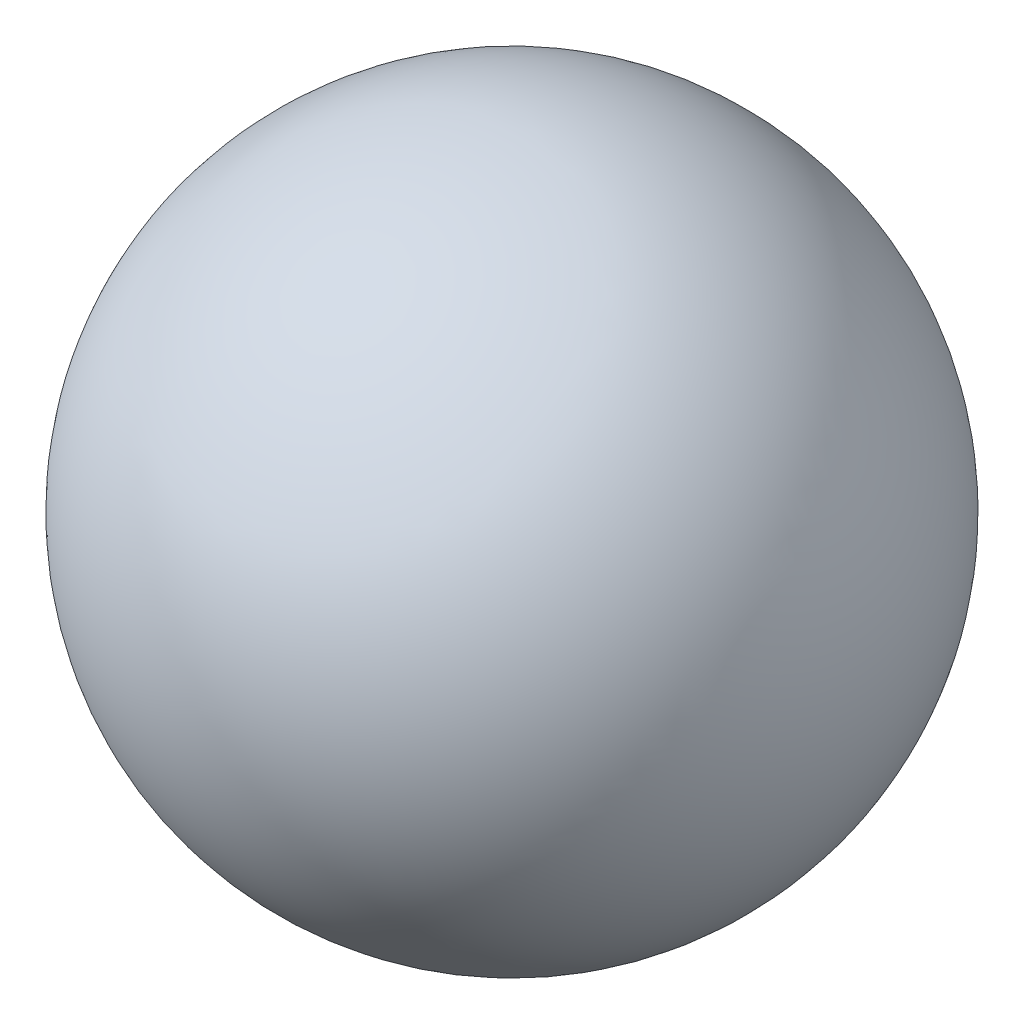
ISO-10303-21;
HEADER;
FILE_DESCRIPTION(('STEP AP214'),'2;1');
FILE_NAME('part.step','',(''),(''),'','','');
FILE_SCHEMA(('AUTOMOTIVE_DESIGN { 1 0 10303 214 1 1 1 1 }'));
ENDSEC;
DATA;
#1=APPLICATION_CONTEXT('core data for automotive mechanical design processes');
#2=APPLICATION_PROTOCOL_DEFINITION('international standard','automotive_design',2000,#1);
#3=PRODUCT_CONTEXT('',#1,'mechanical');
#4=PRODUCT('Part','Part','',(#3));
#5=PRODUCT_RELATED_PRODUCT_CATEGORY('part','',(#4));
#6=PRODUCT_DEFINITION_FORMATION('','',#4);
#7=PRODUCT_DEFINITION_CONTEXT('part definition',#1,'design');
#8=PRODUCT_DEFINITION('design','',#6,#7);
#9=PRODUCT_DEFINITION_SHAPE('','',#8);
#10=(LENGTH_UNIT() NAMED_UNIT(*) SI_UNIT(.MILLI.,.METRE.));
#11=(NAMED_UNIT(*) PLANE_ANGLE_UNIT() SI_UNIT($,.RADIAN.));
#12=(NAMED_UNIT(*) SI_UNIT($,.STERADIAN.) SOLID_ANGLE_UNIT());
#13=UNCERTAINTY_MEASURE_WITH_UNIT(LENGTH_MEASURE(1.E-05),#10,'distance_accuracy_value','');
#14=(GEOMETRIC_REPRESENTATION_CONTEXT(3) GLOBAL_UNCERTAINTY_ASSIGNED_CONTEXT((#13)) GLOBAL_UNIT_ASSIGNED_CONTEXT((#10,
#11,#12)) REPRESENTATION_CONTEXT('',''));
#15=CARTESIAN_POINT('',(0.,0.,0.));
#16=DIRECTION('',(0.,0.,1.));
#17=DIRECTION('',(1.,0.,0.));
#18=AXIS2_PLACEMENT_3D('',#15,#16,#17);
#19=CARTESIAN_POINT('',(0.,0.,0.));
#20=DIRECTION('',(-1.,0.,0.));
#21=DIRECTION('',(0.,1.,0.));
#22=AXIS2_PLACEMENT_3D('',#19,#20,#21);
#23=SPHERICAL_SURFACE('',#22,12.7);
#24=CARTESIAN_POINT('',(-12.7,0.,0.));
#25=VERTEX_POINT('',#24);
#26=VERTEX_LOOP('',#25);
#27=FACE_BOUND('',#26,.T.);
#28=ADVANCED_FACE('F33',(#27),#23,.T.);
#29=CLOSED_SHELL('',(#28));
#30=MANIFOLD_SOLID_BREP('B2',#29);
#31=ADVANCED_BREP_SHAPE_REPRESENTATION('',(#18,#30),#14);
#32=SHAPE_DEFINITION_REPRESENTATION(#9,#31);
ENDSEC;
END-ISO-10303-21;
